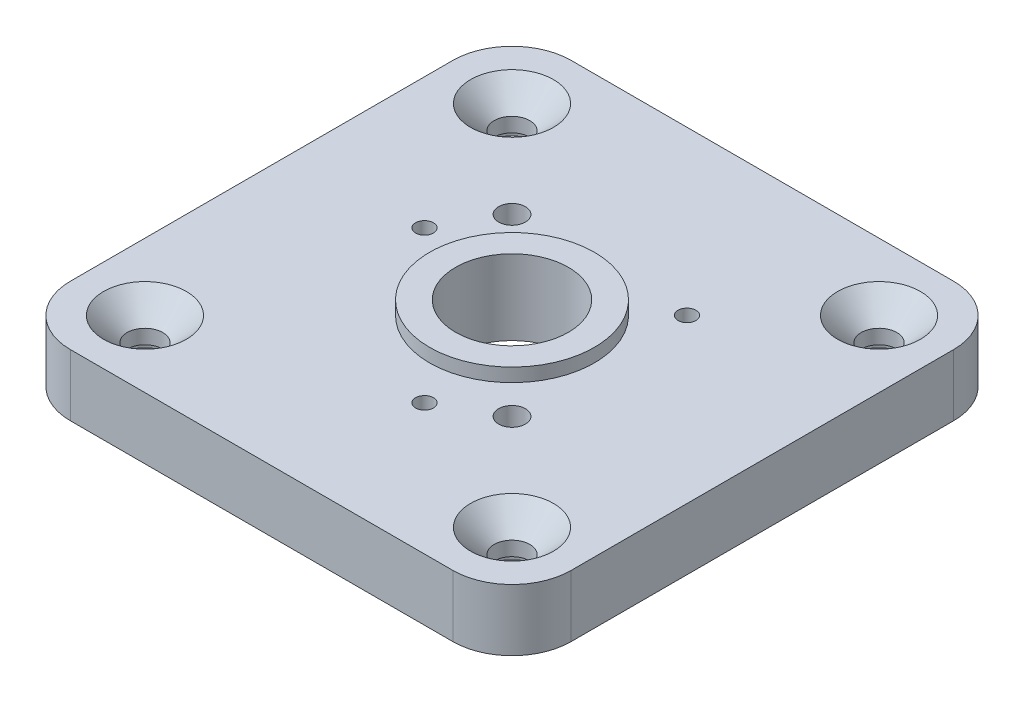
ISO-10303-21;
HEADER;
FILE_DESCRIPTION(('STEP AP214'),'2;1');
FILE_NAME('part.step','',(''),(''),'','','');
FILE_SCHEMA(('AUTOMOTIVE_DESIGN { 1 0 10303 214 1 1 1 1 }'));
ENDSEC;
DATA;
#1=APPLICATION_CONTEXT('core data for automotive mechanical design processes');
#2=APPLICATION_PROTOCOL_DEFINITION('international standard','automotive_design',2000,#1);
#3=PRODUCT_CONTEXT('',#1,'mechanical');
#4=PRODUCT('Part','Part','',(#3));
#5=PRODUCT_RELATED_PRODUCT_CATEGORY('part','',(#4));
#6=PRODUCT_DEFINITION_FORMATION('','',#4);
#7=PRODUCT_DEFINITION_CONTEXT('part definition',#1,'design');
#8=PRODUCT_DEFINITION('design','',#6,#7);
#9=PRODUCT_DEFINITION_SHAPE('','',#8);
#10=(LENGTH_UNIT() NAMED_UNIT(*) SI_UNIT(.MILLI.,.METRE.));
#11=(NAMED_UNIT(*) PLANE_ANGLE_UNIT() SI_UNIT($,.RADIAN.));
#12=(NAMED_UNIT(*) SI_UNIT($,.STERADIAN.) SOLID_ANGLE_UNIT());
#13=UNCERTAINTY_MEASURE_WITH_UNIT(LENGTH_MEASURE(1.E-05),#10,'distance_accuracy_value','');
#14=(GEOMETRIC_REPRESENTATION_CONTEXT(3) GLOBAL_UNCERTAINTY_ASSIGNED_CONTEXT((#13)) GLOBAL_UNIT_ASSIGNED_CONTEXT((#10,
#11,#12)) REPRESENTATION_CONTEXT('',''));
#15=CARTESIAN_POINT('',(0.,0.,0.));
#16=DIRECTION('',(0.,0.,1.));
#17=DIRECTION('',(1.,0.,0.));
#18=AXIS2_PLACEMENT_3D('',#15,#16,#17);
#19=CARTESIAN_POINT('',(5.65,5.21,-5.64999999999999));
#20=DIRECTION('',(0.,-1.,0.));
#21=DIRECTION('',(0.,0.,-1.));
#22=AXIS2_PLACEMENT_3D('',#19,#20,#21);
#23=CYLINDRICAL_SURFACE('',#22,1.5);
#24=CARTESIAN_POINT('',(5.65,3.21000000000001,-5.64999999999999));
#25=DIRECTION('',(0.,-1.,0.));
#26=DIRECTION('',(0.,0.,-1.));
#27=AXIS2_PLACEMENT_3D('',#24,#25,#26);
#28=CIRCLE('',#27,1.5);
#29=CARTESIAN_POINT('',(5.65,3.21000000000001,-7.14999999999999));
#30=VERTEX_POINT('',#29);
#31=EDGE_CURVE('E147',#30,#30,#28,.F.);
#32=ORIENTED_EDGE('',*,*,#31,.T.);
#33=EDGE_LOOP('',(#32));
#34=FACE_BOUND('',#33,.T.);
#35=CARTESIAN_POINT('',(5.65,2.,-5.64999999999999));
#36=DIRECTION('',(0.,-1.,0.));
#37=DIRECTION('',(0.,0.,-1.));
#38=AXIS2_PLACEMENT_3D('',#35,#36,#37);
#39=CIRCLE('',#38,1.5);
#40=CARTESIAN_POINT('',(5.65,2.,-7.14999999999999));
#41=VERTEX_POINT('',#40);
#42=EDGE_CURVE('E276',#41,#41,#39,.T.);
#43=ORIENTED_EDGE('',*,*,#42,.T.);
#44=EDGE_LOOP('',(#43));
#45=FACE_BOUND('',#44,.T.);
#46=ADVANCED_FACE('F47',(#34,#45),#23,.F.);
#47=CARTESIAN_POINT('',(36.65,5.21,-5.65));
#48=DIRECTION('',(0.,-1.,0.));
#49=DIRECTION('',(0.,0.,-1.));
#50=AXIS2_PLACEMENT_3D('',#47,#48,#49);
#51=CYLINDRICAL_SURFACE('',#50,1.5);
#52=CARTESIAN_POINT('',(36.65,3.21000000000001,-5.65));
#53=DIRECTION('',(0.,-1.,0.));
#54=DIRECTION('',(0.,0.,-1.));
#55=AXIS2_PLACEMENT_3D('',#52,#53,#54);
#56=CIRCLE('',#55,1.5);
#57=CARTESIAN_POINT('',(36.65,3.21000000000001,-7.15));
#58=VERTEX_POINT('',#57);
#59=EDGE_CURVE('E163',#58,#58,#56,.F.);
#60=ORIENTED_EDGE('',*,*,#59,.T.);
#61=EDGE_LOOP('',(#60));
#62=FACE_BOUND('',#61,.T.);
#63=CARTESIAN_POINT('',(36.65,2.,-5.65));
#64=DIRECTION('',(0.,-1.,0.));
#65=DIRECTION('',(0.,0.,-1.));
#66=AXIS2_PLACEMENT_3D('',#63,#64,#65);
#67=CIRCLE('',#66,1.5);
#68=CARTESIAN_POINT('',(36.65,2.,-7.15));
#69=VERTEX_POINT('',#68);
#70=EDGE_CURVE('E273',#69,#69,#67,.T.);
#71=ORIENTED_EDGE('',*,*,#70,.T.);
#72=EDGE_LOOP('',(#71));
#73=FACE_BOUND('',#72,.T.);
#74=ADVANCED_FACE('F376',(#62,#73),#51,.F.);
#75=CARTESIAN_POINT('',(5.65,5.21,-36.65));
#76=DIRECTION('',(0.,-1.,0.));
#77=DIRECTION('',(0.,0.,-1.));
#78=AXIS2_PLACEMENT_3D('',#75,#76,#77);
#79=CYLINDRICAL_SURFACE('',#78,1.5);
#80=CARTESIAN_POINT('',(5.65,3.21000000000001,-36.65));
#81=DIRECTION('',(0.,-1.,0.));
#82=DIRECTION('',(0.,0.,-1.));
#83=AXIS2_PLACEMENT_3D('',#80,#81,#82);
#84=CIRCLE('',#83,1.5);
#85=CARTESIAN_POINT('',(5.65,3.21000000000001,-38.15));
#86=VERTEX_POINT('',#85);
#87=EDGE_CURVE('E169',#86,#86,#84,.F.);
#88=ORIENTED_EDGE('',*,*,#87,.T.);
#89=EDGE_LOOP('',(#88));
#90=FACE_BOUND('',#89,.T.);
#91=CARTESIAN_POINT('',(5.65,2.,-36.65));
#92=DIRECTION('',(0.,-1.,0.));
#93=DIRECTION('',(0.,0.,-1.));
#94=AXIS2_PLACEMENT_3D('',#91,#92,#93);
#95=CIRCLE('',#94,1.5);
#96=CARTESIAN_POINT('',(5.65,2.,-38.15));
#97=VERTEX_POINT('',#96);
#98=EDGE_CURVE('E285',#97,#97,#95,.T.);
#99=ORIENTED_EDGE('',*,*,#98,.T.);
#100=EDGE_LOOP('',(#99));
#101=FACE_BOUND('',#100,.T.);
#102=ADVANCED_FACE('F296',(#90,#101),#79,.F.);
#103=CARTESIAN_POINT('',(36.65,5.21,-36.65));
#104=DIRECTION('',(0.,-1.,0.));
#105=DIRECTION('',(0.,0.,-1.));
#106=AXIS2_PLACEMENT_3D('',#103,#104,#105);
#107=CYLINDRICAL_SURFACE('',#106,1.5);
#108=CARTESIAN_POINT('',(36.65,3.21000000000001,-36.65));
#109=DIRECTION('',(0.,-1.,0.));
#110=DIRECTION('',(0.,0.,-1.));
#111=AXIS2_PLACEMENT_3D('',#108,#109,#110);
#112=CIRCLE('',#111,1.5);
#113=CARTESIAN_POINT('',(36.65,3.21000000000001,-38.15));
#114=VERTEX_POINT('',#113);
#115=EDGE_CURVE('E166',#114,#114,#112,.F.);
#116=ORIENTED_EDGE('',*,*,#115,.T.);
#117=EDGE_LOOP('',(#116));
#118=FACE_BOUND('',#117,.T.);
#119=CARTESIAN_POINT('',(36.65,2.,-36.65));
#120=DIRECTION('',(0.,-1.,0.));
#121=DIRECTION('',(0.,0.,-1.));
#122=AXIS2_PLACEMENT_3D('',#119,#120,#121);
#123=CIRCLE('',#122,1.5);
#124=CARTESIAN_POINT('',(36.65,2.,-38.15));
#125=VERTEX_POINT('',#124);
#126=EDGE_CURVE('E263',#125,#125,#123,.T.);
#127=ORIENTED_EDGE('',*,*,#126,.T.);
#128=EDGE_LOOP('',(#127));
#129=FACE_BOUND('',#128,.T.);
#130=ADVANCED_FACE('F340',(#118,#129),#107,.F.);
#131=CARTESIAN_POINT('',(0.,5.21,0.));
#132=DIRECTION('',(0.,-1.,0.));
#133=DIRECTION('',(0.,0.,-1.));
#134=AXIS2_PLACEMENT_3D('',#131,#132,#133);
#135=PLANE('',#134);
#136=DIRECTION('',(1.,0.,0.));
#137=VECTOR('',#136,1.);
#138=CARTESIAN_POINT('',(0.,5.21,0.));
#139=LINE('',#138,#137);
#140=CARTESIAN_POINT('',(5.,5.21,0.));
#141=VERTEX_POINT('',#140);
#142=CARTESIAN_POINT('',(37.3,5.21,0.));
#143=VERTEX_POINT('',#142);
#144=EDGE_CURVE('E210',#141,#143,#139,.T.);
#145=ORIENTED_EDGE('',*,*,#144,.T.);
#146=CARTESIAN_POINT('',(37.3,5.21,-5.));
#147=DIRECTION('',(0.,-1.,0.));
#148=DIRECTION('',(0.,0.,-1.));
#149=AXIS2_PLACEMENT_3D('',#146,#147,#148);
#150=CIRCLE('',#149,5.);
#151=CARTESIAN_POINT('',(42.3,5.21,-5.));
#152=VERTEX_POINT('',#151);
#153=EDGE_CURVE('E188',#143,#152,#150,.F.);
#154=ORIENTED_EDGE('',*,*,#153,.T.);
#155=DIRECTION('',(0.,0.,-1.));
#156=VECTOR('',#155,1.);
#157=CARTESIAN_POINT('',(42.3,5.21,0.));
#158=LINE('',#157,#156);
#159=CARTESIAN_POINT('',(42.3,5.21,-37.3));
#160=VERTEX_POINT('',#159);
#161=EDGE_CURVE('E131',#152,#160,#158,.T.);
#162=ORIENTED_EDGE('',*,*,#161,.T.);
#163=CARTESIAN_POINT('',(37.3,5.21,-37.3));
#164=DIRECTION('',(0.,-1.,0.));
#165=DIRECTION('',(0.,0.,-1.));
#166=AXIS2_PLACEMENT_3D('',#163,#164,#165);
#167=CIRCLE('',#166,5.);
#168=CARTESIAN_POINT('',(37.3,5.21,-42.3));
#169=VERTEX_POINT('',#168);
#170=EDGE_CURVE('E67',#160,#169,#167,.F.);
#171=ORIENTED_EDGE('',*,*,#170,.T.);
#172=DIRECTION('',(-1.,0.,0.));
#173=VECTOR('',#172,1.);
#174=CARTESIAN_POINT('',(0.,5.21,-42.3));
#175=LINE('',#174,#173);
#176=CARTESIAN_POINT('',(4.99999999999999,5.21,-42.3));
#177=VERTEX_POINT('',#176);
#178=EDGE_CURVE('E151',#169,#177,#175,.T.);
#179=ORIENTED_EDGE('',*,*,#178,.T.);
#180=CARTESIAN_POINT('',(4.99999999999999,5.21,-37.3));
#181=DIRECTION('',(0.,-1.,0.));
#182=DIRECTION('',(0.,0.,-1.));
#183=AXIS2_PLACEMENT_3D('',#180,#181,#182);
#184=CIRCLE('',#183,5.);
#185=CARTESIAN_POINT('',(0.,5.21,-37.3));
#186=VERTEX_POINT('',#185);
#187=EDGE_CURVE('E184',#177,#186,#184,.F.);
#188=ORIENTED_EDGE('',*,*,#187,.T.);
#189=DIRECTION('',(0.,0.,1.));
#190=VECTOR('',#189,1.);
#191=CARTESIAN_POINT('',(0.,5.21,0.));
#192=LINE('',#191,#190);
#193=CARTESIAN_POINT('',(0.,5.21,-5.));
#194=VERTEX_POINT('',#193);
#195=EDGE_CURVE('E141',#186,#194,#192,.T.);
#196=ORIENTED_EDGE('',*,*,#195,.T.);
#197=CARTESIAN_POINT('',(5.,5.21,-5.));
#198=DIRECTION('',(0.,-1.,0.));
#199=DIRECTION('',(0.,0.,-1.));
#200=AXIS2_PLACEMENT_3D('',#197,#198,#199);
#201=CIRCLE('',#200,5.);
#202=EDGE_CURVE('E186',#194,#141,#201,.F.);
#203=ORIENTED_EDGE('',*,*,#202,.T.);
#204=EDGE_LOOP('',(#145,#154,#162,#171,#179,#188,#196,#203));
#205=FACE_BOUND('',#204,.T.);
#206=CARTESIAN_POINT('',(11.0560751152796,5.21,-23.8546590213211));
#207=DIRECTION('',(0.,1.,0.));
#208=DIRECTION('',(0.,0.,1.));
#209=AXIS2_PLACEMENT_3D('',#206,#207,#208);
#210=CIRCLE('',#209,0.75565);
#211=CARTESIAN_POINT('',(11.0560751152796,5.21,-23.0990090213211));
#212=VERTEX_POINT('',#211);
#213=EDGE_CURVE('E223',#212,#212,#210,.T.);
#214=ORIENTED_EDGE('',*,*,#213,.F.);
#215=EDGE_LOOP('',(#214));
#216=FACE_BOUND('',#215,.T.);
#217=CARTESIAN_POINT('',(28.5392658633994,5.21,-28.5392658633994));
#218=DIRECTION('',(0.,1.,0.));
#219=DIRECTION('',(0.,0.,1.));
#220=AXIS2_PLACEMENT_3D('',#217,#218,#219);
#221=CIRCLE('',#220,0.755649999999999);
#222=CARTESIAN_POINT('',(28.5392658633994,5.21,-27.7836158633994));
#223=VERTEX_POINT('',#222);
#224=EDGE_CURVE('E237',#223,#223,#221,.T.);
#225=ORIENTED_EDGE('',*,*,#224,.F.);
#226=EDGE_LOOP('',(#225));
#227=FACE_BOUND('',#226,.T.);
#228=CARTESIAN_POINT('',(23.8546590213217,5.21,-11.0560751152795));
#229=DIRECTION('',(0.,1.,0.));
#230=DIRECTION('',(0.,0.,1.));
#231=AXIS2_PLACEMENT_3D('',#228,#229,#230);
#232=CIRCLE('',#231,0.755649999999999);
#233=CARTESIAN_POINT('',(23.8546590213217,5.21,-10.3004251152795));
#234=VERTEX_POINT('',#233);
#235=EDGE_CURVE('E230',#234,#234,#232,.T.);
#236=ORIENTED_EDGE('',*,*,#235,.F.);
#237=EDGE_LOOP('',(#236));
#238=FACE_BOUND('',#237,.T.);
#239=CARTESIAN_POINT('',(28.5392658633994,5.21,-13.7607341366006));
#240=DIRECTION('',(0.,1.,0.));
#241=DIRECTION('',(0.,0.,1.));
#242=AXIS2_PLACEMENT_3D('',#239,#240,#241);
#243=CIRCLE('',#242,1.1303);
#244=CARTESIAN_POINT('',(28.5392658633994,5.21,-12.6304341366006));
#245=VERTEX_POINT('',#244);
#246=EDGE_CURVE('E249',#245,#245,#243,.T.);
#247=ORIENTED_EDGE('',*,*,#246,.F.);
#248=EDGE_LOOP('',(#247));
#249=FACE_BOUND('',#248,.T.);
#250=CARTESIAN_POINT('',(13.7607341366006,5.21,-28.5392658633995));
#251=DIRECTION('',(0.,1.,0.));
#252=DIRECTION('',(0.,0.,1.));
#253=AXIS2_PLACEMENT_3D('',#250,#251,#252);
#254=CIRCLE('',#253,1.1303);
#255=CARTESIAN_POINT('',(13.7607341366006,5.21,-27.4089658633995));
#256=VERTEX_POINT('',#255);
#257=EDGE_CURVE('E242',#256,#256,#254,.T.);
#258=ORIENTED_EDGE('',*,*,#257,.F.);
#259=EDGE_LOOP('',(#258));
#260=FACE_BOUND('',#259,.T.);
#261=CARTESIAN_POINT('',(5.65,5.21,-36.65));
#262=DIRECTION('',(0.,-1.,0.));
#263=DIRECTION('',(0.,0.,-1.));
#264=AXIS2_PLACEMENT_3D('',#261,#262,#263);
#265=CIRCLE('',#264,3.5);
#266=CARTESIAN_POINT('',(5.65,5.21,-40.15));
#267=VERTEX_POINT('',#266);
#268=EDGE_CURVE('E150',#267,#267,#265,.T.);
#269=ORIENTED_EDGE('',*,*,#268,.T.);
#270=EDGE_LOOP('',(#269));
#271=FACE_BOUND('',#270,.T.);
#272=CARTESIAN_POINT('',(36.65,5.21,-36.65));
#273=DIRECTION('',(0.,-1.,0.));
#274=DIRECTION('',(0.,0.,-1.));
#275=AXIS2_PLACEMENT_3D('',#272,#273,#274);
#276=CIRCLE('',#275,3.5);
#277=CARTESIAN_POINT('',(36.65,5.21,-40.15));
#278=VERTEX_POINT('',#277);
#279=EDGE_CURVE('E154',#278,#278,#276,.T.);
#280=ORIENTED_EDGE('',*,*,#279,.T.);
#281=EDGE_LOOP('',(#280));
#282=FACE_BOUND('',#281,.T.);
#283=CARTESIAN_POINT('',(36.65,5.21,-5.65));
#284=DIRECTION('',(0.,-1.,0.));
#285=DIRECTION('',(0.,0.,-1.));
#286=AXIS2_PLACEMENT_3D('',#283,#284,#285);
#287=CIRCLE('',#286,3.5);
#288=CARTESIAN_POINT('',(36.65,5.21,-9.15));
#289=VERTEX_POINT('',#288);
#290=EDGE_CURVE('E157',#289,#289,#287,.T.);
#291=ORIENTED_EDGE('',*,*,#290,.T.);
#292=EDGE_LOOP('',(#291));
#293=FACE_BOUND('',#292,.T.);
#294=CARTESIAN_POINT('',(5.65,5.21,-5.64999999999999));
#295=DIRECTION('',(0.,-1.,0.));
#296=DIRECTION('',(0.,0.,-1.));
#297=AXIS2_PLACEMENT_3D('',#294,#295,#296);
#298=CIRCLE('',#297,3.5);
#299=CARTESIAN_POINT('',(5.65,5.21,-9.15));
#300=VERTEX_POINT('',#299);
#301=EDGE_CURVE('E160',#300,#300,#298,.T.);
#302=ORIENTED_EDGE('',*,*,#301,.T.);
#303=EDGE_LOOP('',(#302));
#304=FACE_BOUND('',#303,.T.);
#305=CARTESIAN_POINT('',(21.15,5.21,-21.15));
#306=DIRECTION('',(0.,-1.,0.));
#307=DIRECTION('',(0.,0.,-1.));
#308=AXIS2_PLACEMENT_3D('',#305,#306,#307);
#309=CIRCLE('',#308,6.96);
#310=CARTESIAN_POINT('',(21.15,5.21,-28.11));
#311=VERTEX_POINT('',#310);
#312=EDGE_CURVE('E172',#311,#311,#309,.F.);
#313=ORIENTED_EDGE('',*,*,#312,.F.);
#314=EDGE_LOOP('',(#313));
#315=FACE_BOUND('',#314,.T.);
#316=ADVANCED_FACE('F314',(#205,#216,#227,#238,#249,#260,#271,#282,#293,#304,#315),#135,.F.);
#317=CARTESIAN_POINT('',(0.,0.,0.));
#318=DIRECTION('',(0.,-1.,0.));
#319=DIRECTION('',(0.,0.,-1.));
#320=AXIS2_PLACEMENT_3D('',#317,#318,#319);
#321=PLANE('',#320);
#322=CARTESIAN_POINT('',(5.64999999999995,0.,-36.6499999999999));
#323=DIRECTION('',(0.,-1.,0.));
#324=DIRECTION('',(0.,0.,-1.));
#325=AXIS2_PLACEMENT_3D('',#322,#323,#324);
#326=CIRCLE('',#325,4.);
#327=CARTESIAN_POINT('',(5.64999999999995,0.,-40.6499999999999));
#328=VERTEX_POINT('',#327);
#329=EDGE_CURVE('E288',#328,#328,#326,.T.);
#330=ORIENTED_EDGE('',*,*,#329,.F.);
#331=EDGE_LOOP('',(#330));
#332=FACE_BOUND('',#331,.T.);
#333=CARTESIAN_POINT('',(5.65000000000011,0.,-5.64999999999988));
#334=DIRECTION('',(0.,-1.,0.));
#335=DIRECTION('',(0.,0.,-1.));
#336=AXIS2_PLACEMENT_3D('',#333,#334,#335);
#337=CIRCLE('',#336,4.00000000000001);
#338=CARTESIAN_POINT('',(5.65000000000011,0.,-9.64999999999989));
#339=VERTEX_POINT('',#338);
#340=EDGE_CURVE('E279',#339,#339,#337,.T.);
#341=ORIENTED_EDGE('',*,*,#340,.F.);
#342=EDGE_LOOP('',(#341));
#343=FACE_BOUND('',#342,.T.);
#344=CARTESIAN_POINT('',(36.6500000000002,0.,-5.65000000000015));
#345=DIRECTION('',(0.,-1.,0.));
#346=DIRECTION('',(0.,0.,-1.));
#347=AXIS2_PLACEMENT_3D('',#344,#345,#346);
#348=CIRCLE('',#347,4.);
#349=CARTESIAN_POINT('',(36.6500000000002,0.,-9.65000000000015));
#350=VERTEX_POINT('',#349);
#351=EDGE_CURVE('E269',#350,#350,#348,.T.);
#352=ORIENTED_EDGE('',*,*,#351,.F.);
#353=EDGE_LOOP('',(#352));
#354=FACE_BOUND('',#353,.T.);
#355=CARTESIAN_POINT('',(36.65,0.,-36.65));
#356=DIRECTION('',(0.,-1.,0.));
#357=DIRECTION('',(0.,0.,-1.));
#358=AXIS2_PLACEMENT_3D('',#355,#356,#357);
#359=CIRCLE('',#358,4.00000000000001);
#360=CARTESIAN_POINT('',(36.65,0.,-40.65));
#361=VERTEX_POINT('',#360);
#362=EDGE_CURVE('E260',#361,#361,#359,.T.);
#363=ORIENTED_EDGE('',*,*,#362,.F.);
#364=EDGE_LOOP('',(#363));
#365=FACE_BOUND('',#364,.T.);
#366=CARTESIAN_POINT('',(13.7607341366006,0.,-28.5392658633995));
#367=DIRECTION('',(0.,1.,0.));
#368=DIRECTION('',(0.,0.,1.));
#369=AXIS2_PLACEMENT_3D('',#366,#367,#368);
#370=CIRCLE('',#369,1.1303);
#371=CARTESIAN_POINT('',(13.7607341366006,0.,-27.4089658633995));
#372=VERTEX_POINT('',#371);
#373=EDGE_CURVE('E245',#372,#372,#370,.T.);
#374=ORIENTED_EDGE('',*,*,#373,.T.);
#375=EDGE_LOOP('',(#374));
#376=FACE_BOUND('',#375,.T.);
#377=CARTESIAN_POINT('',(28.5392658633994,0.,-13.7607341366006));
#378=DIRECTION('',(0.,1.,0.));
#379=DIRECTION('',(0.,0.,1.));
#380=AXIS2_PLACEMENT_3D('',#377,#378,#379);
#381=CIRCLE('',#380,1.1303);
#382=CARTESIAN_POINT('',(28.5392658633994,0.,-12.6304341366006));
#383=VERTEX_POINT('',#382);
#384=EDGE_CURVE('E234',#383,#383,#381,.T.);
#385=ORIENTED_EDGE('',*,*,#384,.T.);
#386=EDGE_LOOP('',(#385));
#387=FACE_BOUND('',#386,.T.);
#388=CARTESIAN_POINT('',(23.8546590213217,0.,-11.0560751152795));
#389=DIRECTION('',(0.,1.,0.));
#390=DIRECTION('',(0.,0.,1.));
#391=AXIS2_PLACEMENT_3D('',#388,#389,#390);
#392=CIRCLE('',#391,0.755649999999999);
#393=CARTESIAN_POINT('',(23.8546590213217,0.,-10.3004251152795));
#394=VERTEX_POINT('',#393);
#395=EDGE_CURVE('E233',#394,#394,#392,.T.);
#396=ORIENTED_EDGE('',*,*,#395,.T.);
#397=EDGE_LOOP('',(#396));
#398=FACE_BOUND('',#397,.T.);
#399=CARTESIAN_POINT('',(28.5392658633994,0.,-28.5392658633994));
#400=DIRECTION('',(0.,1.,0.));
#401=DIRECTION('',(0.,0.,1.));
#402=AXIS2_PLACEMENT_3D('',#399,#400,#401);
#403=CIRCLE('',#402,0.755649999999999);
#404=CARTESIAN_POINT('',(28.5392658633994,0.,-27.7836158633994));
#405=VERTEX_POINT('',#404);
#406=EDGE_CURVE('E228',#405,#405,#403,.T.);
#407=ORIENTED_EDGE('',*,*,#406,.T.);
#408=EDGE_LOOP('',(#407));
#409=FACE_BOUND('',#408,.T.);
#410=CARTESIAN_POINT('',(11.0560751152796,0.,-23.8546590213211));
#411=DIRECTION('',(0.,1.,0.));
#412=DIRECTION('',(0.,0.,1.));
#413=AXIS2_PLACEMENT_3D('',#410,#411,#412);
#414=CIRCLE('',#413,0.75565);
#415=CARTESIAN_POINT('',(11.0560751152796,0.,-23.0990090213211));
#416=VERTEX_POINT('',#415);
#417=EDGE_CURVE('E220',#416,#416,#414,.T.);
#418=ORIENTED_EDGE('',*,*,#417,.T.);
#419=EDGE_LOOP('',(#418));
#420=FACE_BOUND('',#419,.T.);
#421=DIRECTION('',(0.,0.,-1.));
#422=VECTOR('',#421,1.);
#423=CARTESIAN_POINT('',(42.3,0.,0.));
#424=LINE('',#423,#422);
#425=CARTESIAN_POINT('',(42.3,0.,-5.));
#426=VERTEX_POINT('',#425);
#427=CARTESIAN_POINT('',(42.3,0.,-37.3));
#428=VERTEX_POINT('',#427);
#429=EDGE_CURVE('E129',#426,#428,#424,.T.);
#430=ORIENTED_EDGE('',*,*,#429,.F.);
#431=CARTESIAN_POINT('',(37.3,0.,-5.));
#432=DIRECTION('',(0.,-1.,0.));
#433=DIRECTION('',(0.,0.,-1.));
#434=AXIS2_PLACEMENT_3D('',#431,#432,#433);
#435=CIRCLE('',#434,5.);
#436=CARTESIAN_POINT('',(37.3,0.,0.));
#437=VERTEX_POINT('',#436);
#438=EDGE_CURVE('E112',#426,#437,#435,.T.);
#439=ORIENTED_EDGE('',*,*,#438,.T.);
#440=DIRECTION('',(1.,0.,0.));
#441=VECTOR('',#440,1.);
#442=CARTESIAN_POINT('',(0.,0.,0.));
#443=LINE('',#442,#441);
#444=CARTESIAN_POINT('',(5.,0.,0.));
#445=VERTEX_POINT('',#444);
#446=EDGE_CURVE('E139',#445,#437,#443,.T.);
#447=ORIENTED_EDGE('',*,*,#446,.F.);
#448=CARTESIAN_POINT('',(5.,0.,-5.));
#449=DIRECTION('',(0.,-1.,0.));
#450=DIRECTION('',(0.,0.,-1.));
#451=AXIS2_PLACEMENT_3D('',#448,#449,#450);
#452=CIRCLE('',#451,5.);
#453=CARTESIAN_POINT('',(0.,0.,-5.));
#454=VERTEX_POINT('',#453);
#455=EDGE_CURVE('E123',#445,#454,#452,.T.);
#456=ORIENTED_EDGE('',*,*,#455,.T.);
#457=DIRECTION('',(0.,0.,1.));
#458=VECTOR('',#457,1.);
#459=CARTESIAN_POINT('',(0.,0.,0.));
#460=LINE('',#459,#458);
#461=CARTESIAN_POINT('',(0.,0.,-37.3));
#462=VERTEX_POINT('',#461);
#463=EDGE_CURVE('E143',#462,#454,#460,.T.);
#464=ORIENTED_EDGE('',*,*,#463,.F.);
#465=CARTESIAN_POINT('',(4.99999999999999,0.,-37.3));
#466=DIRECTION('',(0.,-1.,0.));
#467=DIRECTION('',(0.,0.,-1.));
#468=AXIS2_PLACEMENT_3D('',#465,#466,#467);
#469=CIRCLE('',#468,5.);
#470=CARTESIAN_POINT('',(4.99999999999999,0.,-42.3));
#471=VERTEX_POINT('',#470);
#472=EDGE_CURVE('E177',#462,#471,#469,.T.);
#473=ORIENTED_EDGE('',*,*,#472,.T.);
#474=DIRECTION('',(-1.,0.,0.));
#475=VECTOR('',#474,1.);
#476=CARTESIAN_POINT('',(0.,0.,-42.3));
#477=LINE('',#476,#475);
#478=CARTESIAN_POINT('',(37.3,0.,-42.3));
#479=VERTEX_POINT('',#478);
#480=EDGE_CURVE('E138',#479,#471,#477,.T.);
#481=ORIENTED_EDGE('',*,*,#480,.F.);
#482=CARTESIAN_POINT('',(37.3,0.,-37.3));
#483=DIRECTION('',(0.,-1.,0.));
#484=DIRECTION('',(0.,0.,-1.));
#485=AXIS2_PLACEMENT_3D('',#482,#483,#484);
#486=CIRCLE('',#485,5.);
#487=EDGE_CURVE('E132',#479,#428,#486,.T.);
#488=ORIENTED_EDGE('',*,*,#487,.T.);
#489=EDGE_LOOP('',(#430,#439,#447,#456,#464,#473,#481,#488));
#490=FACE_BOUND('',#489,.T.);
#491=CARTESIAN_POINT('',(21.15,0.,-21.15));
#492=DIRECTION('',(0.,1.,0.));
#493=DIRECTION('',(0.,0.,1.));
#494=AXIS2_PLACEMENT_3D('',#491,#492,#493);
#495=CIRCLE('',#494,4.7625);
#496=CARTESIAN_POINT('',(21.15,0.,-16.3875));
#497=VERTEX_POINT('',#496);
#498=EDGE_CURVE('E215',#497,#497,#495,.T.);
#499=ORIENTED_EDGE('',*,*,#498,.T.);
#500=EDGE_LOOP('',(#499));
#501=FACE_BOUND('',#500,.T.);
#502=ADVANCED_FACE('F135',(#332,#343,#354,#365,#376,#387,#398,#409,#420,#490,#501),#321,.T.);
#503=CARTESIAN_POINT('',(0.,5.21,0.));
#504=DIRECTION('',(1.,0.,0.));
#505=DIRECTION('',(0.,0.,-1.));
#506=AXIS2_PLACEMENT_3D('',#503,#504,#505);
#507=PLANE('',#506);
#508=ORIENTED_EDGE('',*,*,#463,.T.);
#509=DIRECTION('',(0.,-1.,0.));
#510=VECTOR('',#509,1.);
#511=CARTESIAN_POINT('',(0.,5.21,-5.));
#512=LINE('',#511,#510);
#513=EDGE_CURVE('E193',#454,#194,#512,.F.);
#514=ORIENTED_EDGE('',*,*,#513,.T.);
#515=ORIENTED_EDGE('',*,*,#195,.F.);
#516=DIRECTION('',(0.,-1.,0.));
#517=VECTOR('',#516,1.);
#518=CARTESIAN_POINT('',(0.,5.21,-37.3));
#519=LINE('',#518,#517);
#520=EDGE_CURVE('E190',#186,#462,#519,.T.);
#521=ORIENTED_EDGE('',*,*,#520,.T.);
#522=EDGE_LOOP('',(#508,#514,#515,#521));
#523=FACE_BOUND('',#522,.T.);
#524=ADVANCED_FACE('F206',(#523),#507,.F.);
#525=CARTESIAN_POINT('',(0.,5.21,0.));
#526=DIRECTION('',(0.,0.,-1.));
#527=DIRECTION('',(-1.,0.,0.));
#528=AXIS2_PLACEMENT_3D('',#525,#526,#527);
#529=PLANE('',#528);
#530=ORIENTED_EDGE('',*,*,#446,.T.);
#531=DIRECTION('',(0.,-1.,0.));
#532=VECTOR('',#531,1.);
#533=CARTESIAN_POINT('',(37.3,5.21,0.));
#534=LINE('',#533,#532);
#535=EDGE_CURVE('E117',#437,#143,#534,.F.);
#536=ORIENTED_EDGE('',*,*,#535,.T.);
#537=ORIENTED_EDGE('',*,*,#144,.F.);
#538=DIRECTION('',(0.,-1.,0.));
#539=VECTOR('',#538,1.);
#540=CARTESIAN_POINT('',(5.,5.21,0.));
#541=LINE('',#540,#539);
#542=EDGE_CURVE('E122',#141,#445,#541,.T.);
#543=ORIENTED_EDGE('',*,*,#542,.T.);
#544=EDGE_LOOP('',(#530,#536,#537,#543));
#545=FACE_BOUND('',#544,.T.);
#546=ADVANCED_FACE('F395',(#545),#529,.F.);
#547=CARTESIAN_POINT('',(42.3,5.21,0.));
#548=DIRECTION('',(-1.,0.,0.));
#549=DIRECTION('',(0.,0.,1.));
#550=AXIS2_PLACEMENT_3D('',#547,#548,#549);
#551=PLANE('',#550);
#552=ORIENTED_EDGE('',*,*,#161,.F.);
#553=DIRECTION('',(0.,-1.,0.));
#554=VECTOR('',#553,1.);
#555=CARTESIAN_POINT('',(42.3,5.21,-5.));
#556=LINE('',#555,#554);
#557=EDGE_CURVE('E116',#152,#426,#556,.T.);
#558=ORIENTED_EDGE('',*,*,#557,.T.);
#559=ORIENTED_EDGE('',*,*,#429,.T.);
#560=DIRECTION('',(0.,-1.,0.));
#561=VECTOR('',#560,1.);
#562=CARTESIAN_POINT('',(42.3,5.21,-37.3));
#563=LINE('',#562,#561);
#564=EDGE_CURVE('E133',#428,#160,#563,.F.);
#565=ORIENTED_EDGE('',*,*,#564,.T.);
#566=EDGE_LOOP('',(#552,#558,#559,#565));
#567=FACE_BOUND('',#566,.T.);
#568=ADVANCED_FACE('F128',(#567),#551,.F.);
#569=CARTESIAN_POINT('',(0.,5.21,-42.3));
#570=DIRECTION('',(0.,0.,1.));
#571=DIRECTION('',(1.,0.,0.));
#572=AXIS2_PLACEMENT_3D('',#569,#570,#571);
#573=PLANE('',#572);
#574=ORIENTED_EDGE('',*,*,#480,.T.);
#575=DIRECTION('',(0.,-1.,0.));
#576=VECTOR('',#575,1.);
#577=CARTESIAN_POINT('',(4.99999999999999,5.21,-42.3));
#578=LINE('',#577,#576);
#579=EDGE_CURVE('E13',#471,#177,#578,.F.);
#580=ORIENTED_EDGE('',*,*,#579,.T.);
#581=ORIENTED_EDGE('',*,*,#178,.F.);
#582=DIRECTION('',(0.,-1.,0.));
#583=VECTOR('',#582,1.);
#584=CARTESIAN_POINT('',(37.3,5.21,-42.3));
#585=LINE('',#584,#583);
#586=EDGE_CURVE('E55',#169,#479,#585,.T.);
#587=ORIENTED_EDGE('',*,*,#586,.T.);
#588=EDGE_LOOP('',(#574,#580,#581,#587));
#589=FACE_BOUND('',#588,.T.);
#590=ADVANCED_FACE('F196',(#589),#573,.F.);
#591=CARTESIAN_POINT('',(21.15,5.21,-21.15));
#592=DIRECTION('',(0.,-1.,0.));
#593=DIRECTION('',(0.,0.,-1.));
#594=AXIS2_PLACEMENT_3D('',#591,#592,#593);
#595=CYLINDRICAL_SURFACE('',#594,4.7625);
#596=ORIENTED_EDGE('',*,*,#498,.F.);
#597=EDGE_LOOP('',(#596));
#598=FACE_BOUND('',#597,.T.);
#599=CARTESIAN_POINT('',(21.15,6.35,-21.15));
#600=DIRECTION('',(0.,1.,0.));
#601=DIRECTION('',(0.,0.,1.));
#602=AXIS2_PLACEMENT_3D('',#599,#600,#601);
#603=CIRCLE('',#602,4.7625);
#604=CARTESIAN_POINT('',(21.15,6.35,-16.3875));
#605=VERTEX_POINT('',#604);
#606=EDGE_CURVE('E256',#605,#605,#603,.T.);
#607=ORIENTED_EDGE('',*,*,#606,.T.);
#608=EDGE_LOOP('',(#607));
#609=FACE_BOUND('',#608,.T.);
#610=ADVANCED_FACE('F392',(#598,#609),#595,.F.);
#611=CARTESIAN_POINT('',(11.0560751152796,0.,-23.8546590213211));
#612=DIRECTION('',(0.,1.,0.));
#613=DIRECTION('',(0.,0.,1.));
#614=AXIS2_PLACEMENT_3D('',#611,#612,#613);
#615=CYLINDRICAL_SURFACE('',#614,0.75565);
#616=ORIENTED_EDGE('',*,*,#417,.F.);
#617=EDGE_LOOP('',(#616));
#618=FACE_BOUND('',#617,.T.);
#619=ORIENTED_EDGE('',*,*,#213,.T.);
#620=EDGE_LOOP('',(#619));
#621=FACE_BOUND('',#620,.T.);
#622=ADVANCED_FACE('F334',(#618,#621),#615,.F.);
#623=CARTESIAN_POINT('',(28.5392658633994,0.,-28.5392658633994));
#624=DIRECTION('',(0.,1.,0.));
#625=DIRECTION('',(0.,0.,1.));
#626=AXIS2_PLACEMENT_3D('',#623,#624,#625);
#627=CYLINDRICAL_SURFACE('',#626,0.755649999999999);
#628=ORIENTED_EDGE('',*,*,#406,.F.);
#629=EDGE_LOOP('',(#628));
#630=FACE_BOUND('',#629,.T.);
#631=ORIENTED_EDGE('',*,*,#224,.T.);
#632=EDGE_LOOP('',(#631));
#633=FACE_BOUND('',#632,.T.);
#634=ADVANCED_FACE('F330',(#630,#633),#627,.F.);
#635=CARTESIAN_POINT('',(23.8546590213217,0.,-11.0560751152795));
#636=DIRECTION('',(0.,1.,0.));
#637=DIRECTION('',(0.,0.,1.));
#638=AXIS2_PLACEMENT_3D('',#635,#636,#637);
#639=CYLINDRICAL_SURFACE('',#638,0.755649999999999);
#640=ORIENTED_EDGE('',*,*,#395,.F.);
#641=EDGE_LOOP('',(#640));
#642=FACE_BOUND('',#641,.T.);
#643=ORIENTED_EDGE('',*,*,#235,.T.);
#644=EDGE_LOOP('',(#643));
#645=FACE_BOUND('',#644,.T.);
#646=ADVANCED_FACE('F333',(#642,#645),#639,.F.);
#647=CARTESIAN_POINT('',(28.5392658633994,0.,-13.7607341366006));
#648=DIRECTION('',(0.,1.,0.));
#649=DIRECTION('',(0.,0.,1.));
#650=AXIS2_PLACEMENT_3D('',#647,#648,#649);
#651=CYLINDRICAL_SURFACE('',#650,1.1303);
#652=ORIENTED_EDGE('',*,*,#384,.F.);
#653=EDGE_LOOP('',(#652));
#654=FACE_BOUND('',#653,.T.);
#655=ORIENTED_EDGE('',*,*,#246,.T.);
#656=EDGE_LOOP('',(#655));
#657=FACE_BOUND('',#656,.T.);
#658=ADVANCED_FACE('F641',(#654,#657),#651,.F.);
#659=CARTESIAN_POINT('',(13.7607341366006,0.,-28.5392658633995));
#660=DIRECTION('',(0.,1.,0.));
#661=DIRECTION('',(0.,0.,1.));
#662=AXIS2_PLACEMENT_3D('',#659,#660,#661);
#663=CYLINDRICAL_SURFACE('',#662,1.1303);
#664=ORIENTED_EDGE('',*,*,#373,.F.);
#665=EDGE_LOOP('',(#664));
#666=FACE_BOUND('',#665,.T.);
#667=ORIENTED_EDGE('',*,*,#257,.T.);
#668=EDGE_LOOP('',(#667));
#669=FACE_BOUND('',#668,.T.);
#670=ADVANCED_FACE('F405',(#666,#669),#663,.F.);
#671=CARTESIAN_POINT('',(5.65,3.21000000000001,-5.64999999999999));
#672=DIRECTION('',(0.,1.,0.));
#673=DIRECTION('',(0.,0.,1.));
#674=AXIS2_PLACEMENT_3D('',#671,#672,#673);
#675=CONICAL_SURFACE('',#674,1.5,0.78539816339745);
#676=ORIENTED_EDGE('',*,*,#301,.F.);
#677=EDGE_LOOP('',(#676));
#678=FACE_BOUND('',#677,.T.);
#679=ORIENTED_EDGE('',*,*,#31,.F.);
#680=EDGE_LOOP('',(#679));
#681=FACE_BOUND('',#680,.T.);
#682=ADVANCED_FACE('F401',(#678,#681),#675,.F.);
#683=CARTESIAN_POINT('',(36.65,3.21000000000001,-5.65));
#684=DIRECTION('',(0.,1.,0.));
#685=DIRECTION('',(0.,0.,1.));
#686=AXIS2_PLACEMENT_3D('',#683,#684,#685);
#687=CONICAL_SURFACE('',#686,1.5,0.78539816339745);
#688=ORIENTED_EDGE('',*,*,#290,.F.);
#689=EDGE_LOOP('',(#688));
#690=FACE_BOUND('',#689,.T.);
#691=ORIENTED_EDGE('',*,*,#59,.F.);
#692=EDGE_LOOP('',(#691));
#693=FACE_BOUND('',#692,.T.);
#694=ADVANCED_FACE('F404',(#690,#693),#687,.F.);
#695=CARTESIAN_POINT('',(36.65,3.21000000000001,-36.65));
#696=DIRECTION('',(0.,1.,0.));
#697=DIRECTION('',(0.,0.,1.));
#698=AXIS2_PLACEMENT_3D('',#695,#696,#697);
#699=CONICAL_SURFACE('',#698,1.5,0.78539816339745);
#700=ORIENTED_EDGE('',*,*,#279,.F.);
#701=EDGE_LOOP('',(#700));
#702=FACE_BOUND('',#701,.T.);
#703=ORIENTED_EDGE('',*,*,#115,.F.);
#704=EDGE_LOOP('',(#703));
#705=FACE_BOUND('',#704,.T.);
#706=ADVANCED_FACE('F409',(#702,#705),#699,.F.);
#707=CARTESIAN_POINT('',(5.65,3.21000000000001,-36.65));
#708=DIRECTION('',(0.,1.,0.));
#709=DIRECTION('',(0.,0.,1.));
#710=AXIS2_PLACEMENT_3D('',#707,#708,#709);
#711=CONICAL_SURFACE('',#710,1.5,0.785398163397451);
#712=ORIENTED_EDGE('',*,*,#268,.F.);
#713=EDGE_LOOP('',(#712));
#714=FACE_BOUND('',#713,.T.);
#715=ORIENTED_EDGE('',*,*,#87,.F.);
#716=EDGE_LOOP('',(#715));
#717=FACE_BOUND('',#716,.T.);
#718=ADVANCED_FACE('F370',(#714,#717),#711,.F.);
#719=CARTESIAN_POINT('',(21.15,6.35,-21.15));
#720=DIRECTION('',(0.,1.,0.));
#721=DIRECTION('',(0.,0.,1.));
#722=AXIS2_PLACEMENT_3D('',#719,#720,#721);
#723=PLANE('',#722);
#724=CARTESIAN_POINT('',(21.15,6.35,-21.15));
#725=DIRECTION('',(0.,1.,0.));
#726=DIRECTION('',(0.,0.,1.));
#727=AXIS2_PLACEMENT_3D('',#724,#725,#726);
#728=CIRCLE('',#727,6.96);
#729=CARTESIAN_POINT('',(21.15,6.35,-14.19));
#730=VERTEX_POINT('',#729);
#731=EDGE_CURVE('E246',#730,#730,#728,.T.);
#732=ORIENTED_EDGE('',*,*,#731,.T.);
#733=EDGE_LOOP('',(#732));
#734=FACE_BOUND('',#733,.T.);
#735=ORIENTED_EDGE('',*,*,#606,.F.);
#736=EDGE_LOOP('',(#735));
#737=FACE_BOUND('',#736,.T.);
#738=ADVANCED_FACE('F361',(#734,#737),#723,.T.);
#739=CARTESIAN_POINT('',(21.15,6.35,-21.15));
#740=DIRECTION('',(0.,-1.,0.));
#741=DIRECTION('',(0.,0.,-1.));
#742=AXIS2_PLACEMENT_3D('',#739,#740,#741);
#743=CYLINDRICAL_SURFACE('',#742,6.96);
#744=ORIENTED_EDGE('',*,*,#731,.F.);
#745=EDGE_LOOP('',(#744));
#746=FACE_BOUND('',#745,.T.);
#747=ORIENTED_EDGE('',*,*,#312,.T.);
#748=EDGE_LOOP('',(#747));
#749=FACE_BOUND('',#748,.T.);
#750=ADVANCED_FACE('F358',(#746,#749),#743,.T.);
#751=CARTESIAN_POINT('',(36.65,2.,-36.65));
#752=DIRECTION('',(0.,-1.,0.));
#753=DIRECTION('',(0.,0.,-1.));
#754=AXIS2_PLACEMENT_3D('',#751,#752,#753);
#755=CYLINDRICAL_SURFACE('',#754,4.00000000000001);
#756=CARTESIAN_POINT('',(36.65,2.,-36.65));
#757=DIRECTION('',(0.,-1.,0.));
#758=DIRECTION('',(0.,0.,-1.));
#759=AXIS2_PLACEMENT_3D('',#756,#757,#758);
#760=CIRCLE('',#759,4.00000000000001);
#761=CARTESIAN_POINT('',(36.65,2.,-40.65));
#762=VERTEX_POINT('',#761);
#763=EDGE_CURVE('E259',#762,#762,#760,.T.);
#764=ORIENTED_EDGE('',*,*,#763,.F.);
#765=EDGE_LOOP('',(#764));
#766=FACE_BOUND('',#765,.T.);
#767=ORIENTED_EDGE('',*,*,#362,.T.);
#768=EDGE_LOOP('',(#767));
#769=FACE_BOUND('',#768,.T.);
#770=ADVANCED_FACE('F360',(#766,#769),#755,.F.);
#771=CARTESIAN_POINT('',(36.65,2.,-36.65));
#772=DIRECTION('',(0.,-1.,0.));
#773=DIRECTION('',(0.,0.,-1.));
#774=AXIS2_PLACEMENT_3D('',#771,#772,#773);
#775=PLANE('',#774);
#776=ORIENTED_EDGE('',*,*,#126,.F.);
#777=EDGE_LOOP('',(#776));
#778=FACE_BOUND('',#777,.T.);
#779=ORIENTED_EDGE('',*,*,#763,.T.);
#780=EDGE_LOOP('',(#779));
#781=FACE_BOUND('',#780,.T.);
#782=ADVANCED_FACE('F308',(#778,#781),#775,.T.);
#783=CARTESIAN_POINT('',(5.64999999999995,2.,-36.6499999999999));
#784=DIRECTION('',(0.,-1.,0.));
#785=DIRECTION('',(0.,0.,-1.));
#786=AXIS2_PLACEMENT_3D('',#783,#784,#785);
#787=CYLINDRICAL_SURFACE('',#786,4.);
#788=CARTESIAN_POINT('',(5.64999999999995,2.,-36.6499999999999));
#789=DIRECTION('',(0.,-1.,0.));
#790=DIRECTION('',(0.,0.,-1.));
#791=AXIS2_PLACEMENT_3D('',#788,#789,#790);
#792=CIRCLE('',#791,4.);
#793=CARTESIAN_POINT('',(5.64999999999995,2.,-40.6499999999999));
#794=VERTEX_POINT('',#793);
#795=EDGE_CURVE('E268',#794,#794,#792,.T.);
#796=ORIENTED_EDGE('',*,*,#795,.F.);
#797=EDGE_LOOP('',(#796));
#798=FACE_BOUND('',#797,.T.);
#799=ORIENTED_EDGE('',*,*,#329,.T.);
#800=EDGE_LOOP('',(#799));
#801=FACE_BOUND('',#800,.T.);
#802=ADVANCED_FACE('F302',(#798,#801),#787,.F.);
#803=CARTESIAN_POINT('',(5.64999999999995,2.,-36.6499999999999));
#804=DIRECTION('',(0.,-1.,0.));
#805=DIRECTION('',(0.,0.,-1.));
#806=AXIS2_PLACEMENT_3D('',#803,#804,#805);
#807=PLANE('',#806);
#808=ORIENTED_EDGE('',*,*,#98,.F.);
#809=EDGE_LOOP('',(#808));
#810=FACE_BOUND('',#809,.T.);
#811=ORIENTED_EDGE('',*,*,#795,.T.);
#812=EDGE_LOOP('',(#811));
#813=FACE_BOUND('',#812,.T.);
#814=ADVANCED_FACE('F298',(#810,#813),#807,.T.);
#815=CARTESIAN_POINT('',(36.6500000000002,2.,-5.65000000000015));
#816=DIRECTION('',(0.,-1.,0.));
#817=DIRECTION('',(0.,0.,-1.));
#818=AXIS2_PLACEMENT_3D('',#815,#816,#817);
#819=CYLINDRICAL_SURFACE('',#818,4.);
#820=CARTESIAN_POINT('',(36.6500000000002,2.,-5.65000000000015));
#821=DIRECTION('',(0.,-1.,0.));
#822=DIRECTION('',(0.,0.,-1.));
#823=AXIS2_PLACEMENT_3D('',#820,#821,#822);
#824=CIRCLE('',#823,4.);
#825=CARTESIAN_POINT('',(36.6500000000002,2.,-9.65000000000015));
#826=VERTEX_POINT('',#825);
#827=EDGE_CURVE('E272',#826,#826,#824,.T.);
#828=ORIENTED_EDGE('',*,*,#827,.F.);
#829=EDGE_LOOP('',(#828));
#830=FACE_BOUND('',#829,.T.);
#831=ORIENTED_EDGE('',*,*,#351,.T.);
#832=EDGE_LOOP('',(#831));
#833=FACE_BOUND('',#832,.T.);
#834=ADVANCED_FACE('F301',(#830,#833),#819,.F.);
#835=CARTESIAN_POINT('',(36.6500000000002,2.,-5.65000000000015));
#836=DIRECTION('',(0.,-1.,0.));
#837=DIRECTION('',(0.,0.,-1.));
#838=AXIS2_PLACEMENT_3D('',#835,#836,#837);
#839=PLANE('',#838);
#840=ORIENTED_EDGE('',*,*,#70,.F.);
#841=EDGE_LOOP('',(#840));
#842=FACE_BOUND('',#841,.T.);
#843=ORIENTED_EDGE('',*,*,#827,.T.);
#844=EDGE_LOOP('',(#843));
#845=FACE_BOUND('',#844,.T.);
#846=ADVANCED_FACE('F557',(#842,#845),#839,.T.);
#847=CARTESIAN_POINT('',(5.65000000000011,2.,-5.64999999999988));
#848=DIRECTION('',(0.,-1.,0.));
#849=DIRECTION('',(0.,0.,-1.));
#850=AXIS2_PLACEMENT_3D('',#847,#848,#849);
#851=CYLINDRICAL_SURFACE('',#850,4.00000000000001);
#852=CARTESIAN_POINT('',(5.65000000000011,2.,-5.64999999999988));
#853=DIRECTION('',(0.,-1.,0.));
#854=DIRECTION('',(0.,0.,-1.));
#855=AXIS2_PLACEMENT_3D('',#852,#853,#854);
#856=CIRCLE('',#855,4.00000000000001);
#857=CARTESIAN_POINT('',(5.65000000000011,2.,-9.64999999999989));
#858=VERTEX_POINT('',#857);
#859=EDGE_CURVE('E282',#858,#858,#856,.T.);
#860=ORIENTED_EDGE('',*,*,#859,.F.);
#861=EDGE_LOOP('',(#860));
#862=FACE_BOUND('',#861,.T.);
#863=ORIENTED_EDGE('',*,*,#340,.T.);
#864=EDGE_LOOP('',(#863));
#865=FACE_BOUND('',#864,.T.);
#866=ADVANCED_FACE('F566',(#862,#865),#851,.F.);
#867=CARTESIAN_POINT('',(5.65000000000011,2.,-5.64999999999988));
#868=DIRECTION('',(0.,-1.,0.));
#869=DIRECTION('',(0.,0.,-1.));
#870=AXIS2_PLACEMENT_3D('',#867,#868,#869);
#871=PLANE('',#870);
#872=ORIENTED_EDGE('',*,*,#42,.F.);
#873=EDGE_LOOP('',(#872));
#874=FACE_BOUND('',#873,.T.);
#875=ORIENTED_EDGE('',*,*,#859,.T.);
#876=EDGE_LOOP('',(#875));
#877=FACE_BOUND('',#876,.T.);
#878=ADVANCED_FACE('F420',(#874,#877),#871,.T.);
#879=CARTESIAN_POINT('',(37.3,5.21,-5.));
#880=DIRECTION('',(0.,-1.,0.));
#881=DIRECTION('',(0.,0.,-1.));
#882=AXIS2_PLACEMENT_3D('',#879,#880,#881);
#883=CYLINDRICAL_SURFACE('',#882,5.);
#884=ORIENTED_EDGE('',*,*,#153,.F.);
#885=ORIENTED_EDGE('',*,*,#535,.F.);
#886=ORIENTED_EDGE('',*,*,#438,.F.);
#887=ORIENTED_EDGE('',*,*,#557,.F.);
#888=EDGE_LOOP('',(#884,#885,#886,#887));
#889=FACE_BOUND('',#888,.T.);
#890=ADVANCED_FACE('F115',(#889),#883,.T.);
#891=CARTESIAN_POINT('',(5.,5.21,-5.));
#892=DIRECTION('',(0.,-1.,0.));
#893=DIRECTION('',(0.,0.,-1.));
#894=AXIS2_PLACEMENT_3D('',#891,#892,#893);
#895=CYLINDRICAL_SURFACE('',#894,5.);
#896=ORIENTED_EDGE('',*,*,#202,.F.);
#897=ORIENTED_EDGE('',*,*,#513,.F.);
#898=ORIENTED_EDGE('',*,*,#455,.F.);
#899=ORIENTED_EDGE('',*,*,#542,.F.);
#900=EDGE_LOOP('',(#896,#897,#898,#899));
#901=FACE_BOUND('',#900,.T.);
#902=ADVANCED_FACE('F419',(#901),#895,.T.);
#903=CARTESIAN_POINT('',(4.99999999999999,5.21,-37.3));
#904=DIRECTION('',(0.,-1.,0.));
#905=DIRECTION('',(0.,0.,-1.));
#906=AXIS2_PLACEMENT_3D('',#903,#904,#905);
#907=CYLINDRICAL_SURFACE('',#906,5.);
#908=ORIENTED_EDGE('',*,*,#187,.F.);
#909=ORIENTED_EDGE('',*,*,#579,.F.);
#910=ORIENTED_EDGE('',*,*,#472,.F.);
#911=ORIENTED_EDGE('',*,*,#520,.F.);
#912=EDGE_LOOP('',(#908,#909,#910,#911));
#913=FACE_BOUND('',#912,.T.);
#914=ADVANCED_FACE('F203',(#913),#907,.T.);
#915=CARTESIAN_POINT('',(37.3,5.21,-37.3));
#916=DIRECTION('',(0.,-1.,0.));
#917=DIRECTION('',(0.,0.,-1.));
#918=AXIS2_PLACEMENT_3D('',#915,#916,#917);
#919=CYLINDRICAL_SURFACE('',#918,5.);
#920=ORIENTED_EDGE('',*,*,#170,.F.);
#921=ORIENTED_EDGE('',*,*,#564,.F.);
#922=ORIENTED_EDGE('',*,*,#487,.F.);
#923=ORIENTED_EDGE('',*,*,#586,.F.);
#924=EDGE_LOOP('',(#920,#921,#922,#923));
#925=FACE_BOUND('',#924,.T.);
#926=ADVANCED_FACE('F49',(#925),#919,.T.);
#927=CLOSED_SHELL('',(#46,#74,#102,#130,#316,#502,#524,#546,#568,#590,#610,#622,#634,#646,#658,
#670,#682,#694,#706,#718,#738,#750,#770,#782,#802,#814,#834,#846,#866,#878,#890,#902,#914,#926));
#928=MANIFOLD_SOLID_BREP('B2',#927);
#929=ADVANCED_BREP_SHAPE_REPRESENTATION('',(#18,#928),#14);
#930=SHAPE_DEFINITION_REPRESENTATION(#9,#929);
ENDSEC;
END-ISO-10303-21;
